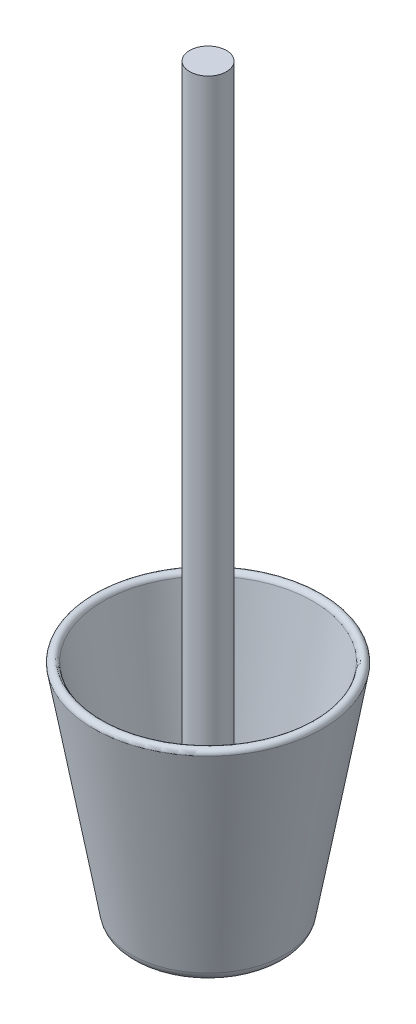
ISO-10303-21;
HEADER;
FILE_DESCRIPTION(('STEP AP214'),'2;1');
FILE_NAME('part.step','',(''),(''),'','','');
FILE_SCHEMA(('AUTOMOTIVE_DESIGN { 1 0 10303 214 1 1 1 1 }'));
ENDSEC;
DATA;
#1=APPLICATION_CONTEXT('core data for automotive mechanical design processes');
#2=APPLICATION_PROTOCOL_DEFINITION('international standard','automotive_design',2000,#1);
#3=PRODUCT_CONTEXT('',#1,'mechanical');
#4=PRODUCT('Part','Part','',(#3));
#5=PRODUCT_RELATED_PRODUCT_CATEGORY('part','',(#4));
#6=PRODUCT_DEFINITION_FORMATION('','',#4);
#7=PRODUCT_DEFINITION_CONTEXT('part definition',#1,'design');
#8=PRODUCT_DEFINITION('design','',#6,#7);
#9=PRODUCT_DEFINITION_SHAPE('','',#8);
#10=(LENGTH_UNIT() NAMED_UNIT(*) SI_UNIT(.MILLI.,.METRE.));
#11=(NAMED_UNIT(*) PLANE_ANGLE_UNIT() SI_UNIT($,.RADIAN.));
#12=(NAMED_UNIT(*) SI_UNIT($,.STERADIAN.) SOLID_ANGLE_UNIT());
#13=UNCERTAINTY_MEASURE_WITH_UNIT(LENGTH_MEASURE(1.E-05),#10,'distance_accuracy_value','');
#14=(GEOMETRIC_REPRESENTATION_CONTEXT(3) GLOBAL_UNCERTAINTY_ASSIGNED_CONTEXT((#13)) GLOBAL_UNIT_ASSIGNED_CONTEXT((#10,
#11,#12)) REPRESENTATION_CONTEXT('',''));
#15=CARTESIAN_POINT('',(0.,0.,0.));
#16=DIRECTION('',(0.,0.,1.));
#17=DIRECTION('',(1.,0.,0.));
#18=AXIS2_PLACEMENT_3D('',#15,#16,#17);
#19=CARTESIAN_POINT('',(0.,0.,0.));
#20=DIRECTION('',(0.,-1.,0.));
#21=DIRECTION('',(0.,0.,-1.));
#22=AXIS2_PLACEMENT_3D('',#19,#20,#21);
#23=PLANE('',#22);
#24=CARTESIAN_POINT('',(0.,0.,0.));
#25=DIRECTION('',(0.,-1.,0.));
#26=DIRECTION('',(0.,0.,-1.));
#27=AXIS2_PLACEMENT_3D('',#24,#25,#26);
#28=CIRCLE('',#27,44.1396466775304);
#29=CARTESIAN_POINT('',(0.,0.,-44.1396466775304));
#30=VERTEX_POINT('',#29);
#31=EDGE_CURVE('E10',#30,#30,#28,.T.);
#32=ORIENTED_EDGE('',*,*,#31,.T.);
#33=EDGE_LOOP('',(#32));
#34=FACE_BOUND('',#33,.T.);
#35=ADVANCED_FACE('F33',(#34),#23,.T.);
#36=CARTESIAN_POINT('',(0.,7.9375,0.));
#37=DIRECTION('',(0.,-1.,0.));
#38=DIRECTION('',(0.,0.,-1.));
#39=AXIS2_PLACEMENT_3D('',#36,#37,#38);
#40=TOROIDAL_SURFACE('',#39,44.1396466775304,7.93749999999999);
#41=CARTESIAN_POINT('',(0.,6.55916758976873,0.));
#42=DIRECTION('',(0.,-1.,0.));
#43=DIRECTION('',(0.,0.,-1.));
#44=AXIS2_PLACEMENT_3D('',#41,#42,#43);
#45=CIRCLE('',#44,51.9565582170647);
#46=CARTESIAN_POINT('',(0.,6.55916758976873,-51.9565582170647));
#47=VERTEX_POINT('',#46);
#48=EDGE_CURVE('E39',#47,#47,#45,.T.);
#49=ORIENTED_EDGE('',*,*,#48,.T.);
#50=EDGE_LOOP('',(#49));
#51=FACE_BOUND('',#50,.T.);
#52=ORIENTED_EDGE('',*,*,#31,.F.);
#53=EDGE_LOOP('',(#52));
#54=FACE_BOUND('',#53,.T.);
#55=ADVANCED_FACE('F100',(#51,#54),#40,.T.);
#56=CARTESIAN_POINT('',(0.,6.55916758976873,0.));
#57=DIRECTION('',(0.,1.,0.));
#58=DIRECTION('',(0.,0.,1.));
#59=AXIS2_PLACEMENT_3D('',#56,#57,#58);
#60=CONICAL_SURFACE('',#59,51.9565582170647,0.174532925199433);
#61=CARTESIAN_POINT('',(0.,152.4,0.));
#62=DIRECTION('',(0.,-1.,0.));
#63=DIRECTION('',(0.,0.,-1.));
#64=AXIS2_PLACEMENT_3D('',#61,#62,#63);
#65=CIRCLE('',#64,77.6722318599701);
#66=CARTESIAN_POINT('',(0.,152.4,-77.6722318599701));
#67=VERTEX_POINT('',#66);
#68=EDGE_CURVE('E43',#67,#67,#65,.T.);
#69=ORIENTED_EDGE('',*,*,#68,.T.);
#70=EDGE_LOOP('',(#69));
#71=FACE_BOUND('',#70,.T.);
#72=ORIENTED_EDGE('',*,*,#48,.F.);
#73=EDGE_LOOP('',(#72));
#74=FACE_BOUND('',#73,.T.);
#75=ADVANCED_FACE('F94',(#71,#74),#60,.T.);
#76=CARTESIAN_POINT('',(0.,152.4,0.));
#77=DIRECTION('',(0.,-1.,0.));
#78=DIRECTION('',(0.,0.,-1.));
#79=AXIS2_PLACEMENT_3D('',#76,#77,#78);
#80=TOROIDAL_SURFACE('',#79,74.4729295646405,3.19930229532964);
#81=CARTESIAN_POINT('',(0.,152.95555301339,0.));
#82=DIRECTION('',(0.,-1.,0.));
#83=DIRECTION('',(0.,0.,-1.));
#84=AXIS2_PLACEMENT_3D('',#81,#82,#83);
#85=CIRCLE('',#84,71.3222318599701);
#86=CARTESIAN_POINT('',(0.,152.95555301339,-71.3222318599701));
#87=VERTEX_POINT('',#86);
#88=EDGE_CURVE('E47',#87,#87,#85,.T.);
#89=ORIENTED_EDGE('',*,*,#88,.T.);
#90=EDGE_LOOP('',(#89));
#91=FACE_BOUND('',#90,.T.);
#92=ORIENTED_EDGE('',*,*,#68,.F.);
#93=EDGE_LOOP('',(#92));
#94=FACE_BOUND('',#93,.T.);
#95=ADVANCED_FACE('F88',(#91,#94),#80,.T.);
#96=CARTESIAN_POINT('',(0.,152.95555301339,0.));
#97=DIRECTION('',(0.,1.,0.));
#98=DIRECTION('',(0.,0.,1.));
#99=AXIS2_PLACEMENT_3D('',#96,#97,#98);
#100=CONICAL_SURFACE('',#99,71.3222318599701,0.174532925199433);
#101=CARTESIAN_POINT('',(0.,7.66183351795375,0.));
#102=DIRECTION('',(0.,-1.,0.));
#103=DIRECTION('',(0.,0.,-1.));
#104=AXIS2_PLACEMENT_3D('',#101,#102,#103);
#105=CIRCLE('',#104,45.7030289854372);
#106=CARTESIAN_POINT('',(0.,7.66183351795375,-45.7030289854372));
#107=VERTEX_POINT('',#106);
#108=EDGE_CURVE('E52',#107,#107,#105,.T.);
#109=ORIENTED_EDGE('',*,*,#108,.T.);
#110=EDGE_LOOP('',(#109));
#111=FACE_BOUND('',#110,.T.);
#112=ORIENTED_EDGE('',*,*,#88,.F.);
#113=EDGE_LOOP('',(#112));
#114=FACE_BOUND('',#113,.T.);
#115=ADVANCED_FACE('F82',(#111,#114),#100,.F.);
#116=CARTESIAN_POINT('',(0.,7.9375,0.));
#117=DIRECTION('',(0.,-1.,0.));
#118=DIRECTION('',(0.,0.,-1.));
#119=AXIS2_PLACEMENT_3D('',#116,#117,#118);
#120=TOROIDAL_SURFACE('',#119,44.1396466775304,1.5875);
#121=CARTESIAN_POINT('',(0.,6.35,0.));
#122=DIRECTION('',(0.,-1.,0.));
#123=DIRECTION('',(0.,0.,-1.));
#124=AXIS2_PLACEMENT_3D('',#121,#122,#123);
#125=CIRCLE('',#124,44.1396466775304);
#126=CARTESIAN_POINT('',(0.,6.35,-44.1396466775304));
#127=VERTEX_POINT('',#126);
#128=EDGE_CURVE('E55',#127,#127,#125,.T.);
#129=ORIENTED_EDGE('',*,*,#128,.T.);
#130=EDGE_LOOP('',(#129));
#131=FACE_BOUND('',#130,.T.);
#132=ORIENTED_EDGE('',*,*,#108,.F.);
#133=EDGE_LOOP('',(#132));
#134=FACE_BOUND('',#133,.T.);
#135=ADVANCED_FACE('F76',(#131,#134),#120,.F.);
#136=CARTESIAN_POINT('',(0.,6.35,0.));
#137=DIRECTION('',(0.,1.,0.));
#138=DIRECTION('',(0.,0.,1.));
#139=AXIS2_PLACEMENT_3D('',#136,#137,#138);
#140=PLANE('',#139);
#141=CARTESIAN_POINT('',(0.,6.35,0.));
#142=DIRECTION('',(0.,1.,0.));
#143=DIRECTION('',(0.,0.,1.));
#144=AXIS2_PLACEMENT_3D('',#141,#142,#143);
#145=CIRCLE('',#144,12.5);
#146=CARTESIAN_POINT('',(0.,6.35,12.5));
#147=VERTEX_POINT('',#146);
#148=EDGE_CURVE('E59',#147,#147,#145,.T.);
#149=ORIENTED_EDGE('',*,*,#148,.F.);
#150=EDGE_LOOP('',(#149));
#151=FACE_BOUND('',#150,.T.);
#152=ORIENTED_EDGE('',*,*,#128,.F.);
#153=EDGE_LOOP('',(#152));
#154=FACE_BOUND('',#153,.T.);
#155=ADVANCED_FACE('F70',(#151,#154),#140,.T.);
#156=CARTESIAN_POINT('',(0.,506.35,0.));
#157=DIRECTION('',(0.,-1.,0.));
#158=DIRECTION('',(0.,0.,-1.));
#159=AXIS2_PLACEMENT_3D('',#156,#157,#158);
#160=CYLINDRICAL_SURFACE('',#159,12.5);
#161=CARTESIAN_POINT('',(0.,506.35,0.));
#162=DIRECTION('',(0.,1.,0.));
#163=DIRECTION('',(0.,0.,1.));
#164=AXIS2_PLACEMENT_3D('',#161,#162,#163);
#165=CIRCLE('',#164,12.5);
#166=CARTESIAN_POINT('',(0.,506.35,12.5));
#167=VERTEX_POINT('',#166);
#168=EDGE_CURVE('E58',#167,#167,#165,.T.);
#169=ORIENTED_EDGE('',*,*,#168,.F.);
#170=EDGE_LOOP('',(#169));
#171=FACE_BOUND('',#170,.T.);
#172=ORIENTED_EDGE('',*,*,#148,.T.);
#173=EDGE_LOOP('',(#172));
#174=FACE_BOUND('',#173,.T.);
#175=ADVANCED_FACE('F67',(#171,#174),#160,.T.);
#176=CARTESIAN_POINT('',(0.,506.35,0.));
#177=DIRECTION('',(0.,1.,0.));
#178=DIRECTION('',(0.,0.,1.));
#179=AXIS2_PLACEMENT_3D('',#176,#177,#178);
#180=PLANE('',#179);
#181=ORIENTED_EDGE('',*,*,#168,.T.);
#182=EDGE_LOOP('',(#181));
#183=FACE_BOUND('',#182,.T.);
#184=ADVANCED_FACE('F65',(#183),#180,.T.);
#185=CLOSED_SHELL('',(#35,#55,#75,#95,#115,#135,#155,#175,#184));
#186=MANIFOLD_SOLID_BREP('B2',#185);
#187=ADVANCED_BREP_SHAPE_REPRESENTATION('',(#18,#186),#14);
#188=SHAPE_DEFINITION_REPRESENTATION(#9,#187);
ENDSEC;
END-ISO-10303-21;
